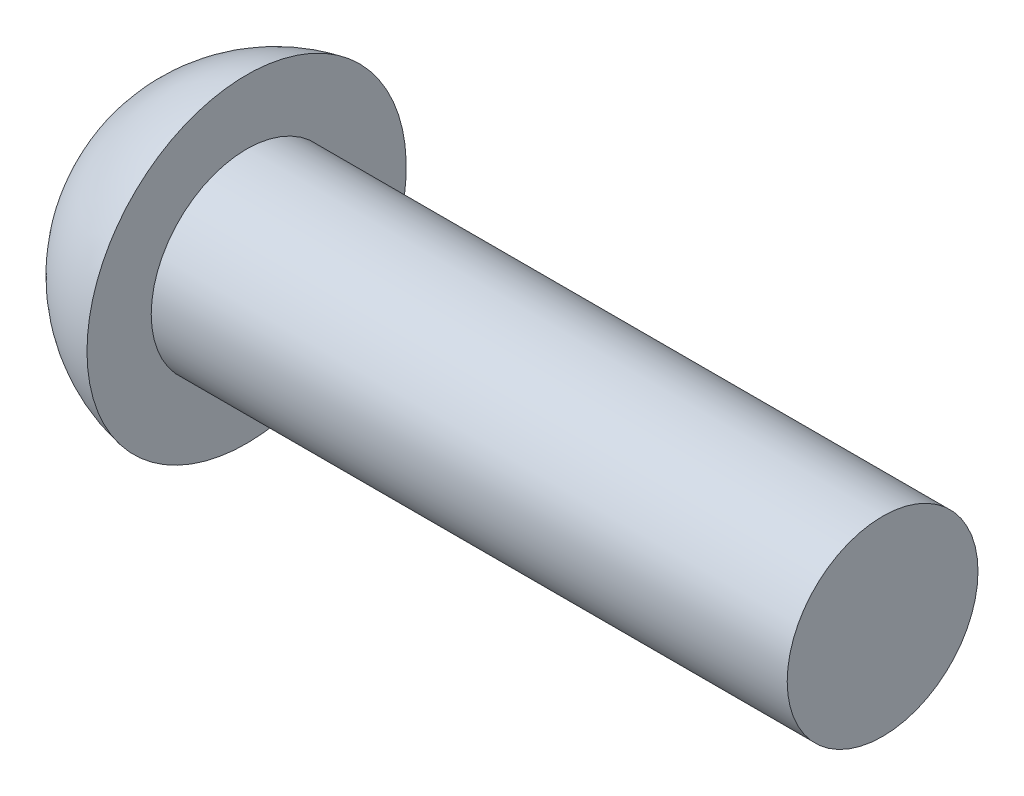
ISO-10303-21;
HEADER;
FILE_DESCRIPTION(('STEP AP214'),'2;1');
FILE_NAME('part.step','',(''),(''),'','','');
FILE_SCHEMA(('AUTOMOTIVE_DESIGN { 1 0 10303 214 1 1 1 1 }'));
ENDSEC;
DATA;
#1=APPLICATION_CONTEXT('core data for automotive mechanical design processes');
#2=APPLICATION_PROTOCOL_DEFINITION('international standard','automotive_design',2000,#1);
#3=PRODUCT_CONTEXT('',#1,'mechanical');
#4=PRODUCT('Part','Part','',(#3));
#5=PRODUCT_RELATED_PRODUCT_CATEGORY('part','',(#4));
#6=PRODUCT_DEFINITION_FORMATION('','',#4);
#7=PRODUCT_DEFINITION_CONTEXT('part definition',#1,'design');
#8=PRODUCT_DEFINITION('design','',#6,#7);
#9=PRODUCT_DEFINITION_SHAPE('','',#8);
#10=(LENGTH_UNIT() NAMED_UNIT(*) SI_UNIT(.MILLI.,.METRE.));
#11=(NAMED_UNIT(*) PLANE_ANGLE_UNIT() SI_UNIT($,.RADIAN.));
#12=(NAMED_UNIT(*) SI_UNIT($,.STERADIAN.) SOLID_ANGLE_UNIT());
#13=UNCERTAINTY_MEASURE_WITH_UNIT(LENGTH_MEASURE(1.E-05),#10,'distance_accuracy_value','');
#14=(GEOMETRIC_REPRESENTATION_CONTEXT(3) GLOBAL_UNCERTAINTY_ASSIGNED_CONTEXT((#13)) GLOBAL_UNIT_ASSIGNED_CONTEXT((#10,
#11,#12)) REPRESENTATION_CONTEXT('',''));
#15=CARTESIAN_POINT('',(0.,0.,0.));
#16=DIRECTION('',(0.,0.,1.));
#17=DIRECTION('',(1.,0.,0.));
#18=AXIS2_PLACEMENT_3D('',#15,#16,#17);
#19=CARTESIAN_POINT('',(5.1,0.,0.));
#20=DIRECTION('',(-1.,0.,0.));
#21=DIRECTION('',(0.,1.,0.));
#22=AXIS2_PLACEMENT_3D('',#19,#20,#21);
#23=SPHERICAL_SURFACE('',#22,5.1);
#24=CARTESIAN_POINT('',(4.2,0.,0.));
#25=DIRECTION('',(-1.,0.,0.));
#26=DIRECTION('',(0.,0.,1.));
#27=AXIS2_PLACEMENT_3D('',#24,#25,#26);
#28=CIRCLE('',#27,5.01996015920445);
#29=CARTESIAN_POINT('',(4.2,0.,5.01996015920445));
#30=VERTEX_POINT('',#29);
#31=EDGE_CURVE('E195',#30,#30,#28,.T.);
#32=ORIENTED_EDGE('',*,*,#31,.T.);
#33=EDGE_LOOP('',(#32));
#34=FACE_BOUND('',#33,.T.);
#35=CARTESIAN_POINT('',(0.222124133816635,0.,0.));
#36=DIRECTION('',(1.,0.,0.));
#37=DIRECTION('',(0.,0.,-1.));
#38=AXIS2_PLACEMENT_3D('',#35,#36,#37);
#39=CIRCLE('',#38,1.4887333656857);
#40=CARTESIAN_POINT('',(0.222124133816634,-0.409999999999995,-1.43116282585382));
#41=VERTEX_POINT('',#40);
#42=CARTESIAN_POINT('',(0.222124133816635,-1.43116282585382,-0.41));
#43=VERTEX_POINT('',#42);
#44=EDGE_CURVE('E317',#41,#43,#39,.F.);
#45=ORIENTED_EDGE('',*,*,#44,.F.);
#46=CARTESIAN_POINT('',(5.1,-0.41,0.));
#47=DIRECTION('',(0.,1.,0.));
#48=DIRECTION('',(0.,0.,1.));
#49=AXIS2_PLACEMENT_3D('',#46,#47,#48);
#50=CIRCLE('',#49,5.08349289367065);
#51=CARTESIAN_POINT('',(0.997910990339142,-0.409999999999989,-3.00245995091019));
#52=VERTEX_POINT('',#51);
#53=EDGE_CURVE('E244',#52,#41,#50,.T.);
#54=ORIENTED_EDGE('',*,*,#53,.F.);
#55=CARTESIAN_POINT('',(5.4822404787185,0.,-0.766655820699222));
#56=DIRECTION('',(0.446197800778958,0.,-0.89493436774996));
#57=DIRECTION('',(-0.89493436774996,0.,-0.446197800778958));
#58=AXIS2_PLACEMENT_3D('',#55,#56,#57);
#59=CIRCLE('',#58,5.02753727674068);
#60=CARTESIAN_POINT('',(0.997910990339142,0.41000000000001,-3.00245995091018));
#61=VERTEX_POINT('',#60);
#62=EDGE_CURVE('E218',#52,#61,#59,.T.);
#63=ORIENTED_EDGE('',*,*,#62,.T.);
#64=CARTESIAN_POINT('',(5.1,0.41,0.));
#65=DIRECTION('',(0.,-1.,0.));
#66=DIRECTION('',(0.,0.,-1.));
#67=AXIS2_PLACEMENT_3D('',#64,#65,#66);
#68=CIRCLE('',#67,5.08349289367065);
#69=CARTESIAN_POINT('',(0.222124133816635,0.410000000000005,-1.43116282585381));
#70=VERTEX_POINT('',#69);
#71=EDGE_CURVE('E273',#70,#61,#68,.T.);
#72=ORIENTED_EDGE('',*,*,#71,.F.);
#73=CARTESIAN_POINT('',(0.222124133816635,1.43116282585382,-0.41));
#74=VERTEX_POINT('',#73);
#75=EDGE_CURVE('E333',#74,#70,#39,.F.);
#76=ORIENTED_EDGE('',*,*,#75,.F.);
#77=CARTESIAN_POINT('',(5.1,0.,-0.41));
#78=DIRECTION('',(0.,0.,1.));
#79=DIRECTION('',(1.,0.,0.));
#80=AXIS2_PLACEMENT_3D('',#77,#78,#79);
#81=CIRCLE('',#80,5.08349289367065);
#82=CARTESIAN_POINT('',(0.997910990339142,3.00245995091019,-0.41));
#83=VERTEX_POINT('',#82);
#84=EDGE_CURVE('E212',#83,#74,#81,.T.);
#85=ORIENTED_EDGE('',*,*,#84,.F.);
#86=CARTESIAN_POINT('',(5.4822404787185,0.766655820699222,0.));
#87=DIRECTION('',(0.446197800778958,0.89493436774996,0.));
#88=DIRECTION('',(-0.89493436774996,0.446197800778958,0.));
#89=AXIS2_PLACEMENT_3D('',#86,#87,#88);
#90=CIRCLE('',#89,5.02753727674068);
#91=CARTESIAN_POINT('',(0.997910990339142,3.00245995091019,0.41));
#92=VERTEX_POINT('',#91);
#93=EDGE_CURVE('E215',#83,#92,#90,.T.);
#94=ORIENTED_EDGE('',*,*,#93,.T.);
#95=CARTESIAN_POINT('',(5.1,0.,0.41));
#96=DIRECTION('',(0.,0.,-1.));
#97=DIRECTION('',(0.,1.,0.));
#98=AXIS2_PLACEMENT_3D('',#95,#96,#97);
#99=CIRCLE('',#98,5.08349289367065);
#100=CARTESIAN_POINT('',(0.222124133816635,1.43116282585381,0.41));
#101=VERTEX_POINT('',#100);
#102=EDGE_CURVE('E203',#101,#92,#99,.T.);
#103=ORIENTED_EDGE('',*,*,#102,.F.);
#104=CARTESIAN_POINT('',(0.222124133816634,0.409999999999995,1.43116282585382));
#105=VERTEX_POINT('',#104);
#106=EDGE_CURVE('E332',#105,#101,#39,.F.);
#107=ORIENTED_EDGE('',*,*,#106,.F.);
#108=CARTESIAN_POINT('',(0.997910990339142,0.409999999999989,3.00245995091019));
#109=VERTEX_POINT('',#108);
#110=EDGE_CURVE('E228',#109,#105,#68,.T.);
#111=ORIENTED_EDGE('',*,*,#110,.F.);
#112=CARTESIAN_POINT('',(5.4822404787185,0.,0.766655820699223));
#113=DIRECTION('',(0.446197800778958,0.,0.89493436774996));
#114=DIRECTION('',(0.89493436774996,0.,-0.446197800778958));
#115=AXIS2_PLACEMENT_3D('',#112,#113,#114);
#116=CIRCLE('',#115,5.02753727674068);
#117=CARTESIAN_POINT('',(0.997910990339142,-0.41000000000001,3.00245995091018));
#118=VERTEX_POINT('',#117);
#119=EDGE_CURVE('E47',#109,#118,#116,.T.);
#120=ORIENTED_EDGE('',*,*,#119,.T.);
#121=CARTESIAN_POINT('',(0.222124133816635,-0.410000000000005,1.43116282585381));
#122=VERTEX_POINT('',#121);
#123=EDGE_CURVE('E225',#122,#118,#50,.T.);
#124=ORIENTED_EDGE('',*,*,#123,.F.);
#125=CARTESIAN_POINT('',(0.222124133816635,-1.43116282585382,0.409999999999999));
#126=VERTEX_POINT('',#125);
#127=EDGE_CURVE('E363',#126,#122,#39,.F.);
#128=ORIENTED_EDGE('',*,*,#127,.F.);
#129=CARTESIAN_POINT('',(0.997910990339142,-3.00245995091019,0.409999999999999));
#130=VERTEX_POINT('',#129);
#131=EDGE_CURVE('E209',#130,#126,#99,.T.);
#132=ORIENTED_EDGE('',*,*,#131,.F.);
#133=CARTESIAN_POINT('',(5.4822404787185,-0.766655820699223,0.));
#134=DIRECTION('',(0.446197800778958,-0.89493436774996,0.));
#135=DIRECTION('',(0.89493436774996,0.446197800778958,0.));
#136=AXIS2_PLACEMENT_3D('',#133,#134,#135);
#137=CIRCLE('',#136,5.02753727674068);
#138=CARTESIAN_POINT('',(0.997910990339142,-3.00245995091019,-0.41));
#139=VERTEX_POINT('',#138);
#140=EDGE_CURVE('E200',#130,#139,#137,.T.);
#141=ORIENTED_EDGE('',*,*,#140,.T.);
#142=EDGE_CURVE('E62',#43,#139,#81,.T.);
#143=ORIENTED_EDGE('',*,*,#142,.F.);
#144=EDGE_LOOP('',(#45,#54,#63,#72,#76,#85,#94,#103,#107,#111,#120,#124,#128,#132,#141,#143));
#145=FACE_BOUND('',#144,.T.);
#146=ADVANCED_FACE('F34',(#34,#145),#23,.T.);
#147=CARTESIAN_POINT('',(3.2,1.90453890928056,-0.41));
#148=DIRECTION('',(0.,0.,1.));
#149=DIRECTION('',(1.,0.,0.));
#150=AXIS2_PLACEMENT_3D('',#147,#148,#149);
#151=PLANE('',#150);
#152=ORIENTED_EDGE('',*,*,#84,.T.);
#153=CARTESIAN_POINT('',(-2.28100022721396,1.61245987855127,-0.41));
#154=CARTESIAN_POINT('',(-1.82356462638218,1.57945364557636,-0.41));
#155=CARTESIAN_POINT('',(-1.36613324244612,1.5463888289135,-0.41));
#156=CARTESIAN_POINT('',(-0.451281022579982,1.4801104064138,-0.41));
#157=CARTESIAN_POINT('',(0.00613981334463958,1.44689680050155,-0.41));
#158=CARTESIAN_POINT('',(0.920968357081412,1.38028921125837,-0.41));
#159=CARTESIAN_POINT('',(1.37837606489363,1.34689522792831,-0.41));
#160=CARTESIAN_POINT('',(2.29317480319328,1.27988185298036,-0.41));
#161=CARTESIAN_POINT('',(2.7505658336868,1.2462624614456,-0.41));
#162=CARTESIAN_POINT('',(3.75464222224439,1.17214568320231,-0.41));
#163=CARTESIAN_POINT('',(4.30132307548286,1.13158718653521,-0.41));
#164=CARTESIAN_POINT('',(5.39464289033181,1.04991236378925,-0.41));
#165=CARTESIAN_POINT('',(5.941281851962,1.00879603797421,-0.41));
#166=CARTESIAN_POINT('',(7.03450145379373,0.925769138257099,-0.41));
#167=CARTESIAN_POINT('',(7.58108209380094,0.88385856178672,-0.41));
#168=CARTESIAN_POINT('',(8.40088322661265,0.820087233843588,-0.41));
#169=CARTESIAN_POINT('',(8.67413889343034,0.798679193153557,-0.41));
#170=CARTESIAN_POINT('',(9.22061934404074,0.755470306470554,-0.41));
#171=CARTESIAN_POINT('',(9.49384412781117,0.733669460196031,-0.41));
#172=CARTESIAN_POINT('',(9.76704955739896,0.711626728086535,-0.41));
#173=B_SPLINE_CURVE_WITH_KNOTS('',3,(#153,#154,#155,#156,#157,#158,#159,#160,#161,#162,#163,
#164,#165,#166,#167,#168,#169,#170,#171,#172),.UNSPECIFIED.,.F.,.F.,(4,2,2,2,2,2,2,2,2,4),(0.,
1.37587451964125,2.75174973665231,4.12762494710747,5.50349965023208,7.14804937834856,
8.79259832870417,10.4371525978129,11.2594312998381,12.0817105912707),.UNSPECIFIED.);
#174=CARTESIAN_POINT('',(3.2,1.21308707436853,-0.41));
#175=VERTEX_POINT('',#174);
#176=EDGE_CURVE('E352',#74,#175,#173,.T.);
#177=ORIENTED_EDGE('',*,*,#176,.T.);
#178=DIRECTION('',(0.,1.,0.));
#179=VECTOR('',#178,1.);
#180=CARTESIAN_POINT('',(3.2,-1.90453890928056,-0.41));
#181=LINE('',#180,#179);
#182=CARTESIAN_POINT('',(3.2,1.90453890928056,-0.41));
#183=VERTEX_POINT('',#182);
#184=EDGE_CURVE('E296',#175,#183,#181,.T.);
#185=ORIENTED_EDGE('',*,*,#184,.T.);
#186=DIRECTION('',(0.89493436774996,-0.446197800778958,0.));
#187=VECTOR('',#186,1.);
#188=CARTESIAN_POINT('',(0.,3.5,-0.41));
#189=LINE('',#188,#187);
#190=EDGE_CURVE('E274',#83,#183,#189,.T.);
#191=ORIENTED_EDGE('',*,*,#190,.F.);
#192=EDGE_LOOP('',(#152,#177,#185,#191));
#193=FACE_BOUND('',#192,.T.);
#194=ADVANCED_FACE('F168',(#193),#151,.T.);
#195=CARTESIAN_POINT('',(3.2,-1.90453890928056,-0.41));
#196=VERTEX_POINT('',#195);
#197=CARTESIAN_POINT('',(3.2,-1.21308707436853,-0.41));
#198=VERTEX_POINT('',#197);
#199=EDGE_CURVE('E294',#196,#198,#181,.T.);
#200=ORIENTED_EDGE('',*,*,#199,.T.);
#201=CARTESIAN_POINT('',(-2.28100022721396,-1.61245987855127,-0.41));
#202=CARTESIAN_POINT('',(-1.82356462638219,-1.57945364557636,-0.41));
#203=CARTESIAN_POINT('',(-1.36613324244613,-1.5463888289135,-0.41));
#204=CARTESIAN_POINT('',(-0.451281022579983,-1.4801104064138,-0.41));
#205=CARTESIAN_POINT('',(0.00613981334463844,-1.44689680050155,-0.41));
#206=CARTESIAN_POINT('',(0.920968357081412,-1.38028921125837,-0.41));
#207=CARTESIAN_POINT('',(1.37837606489363,-1.34689522792831,-0.41));
#208=CARTESIAN_POINT('',(2.29317480319328,-1.27988185298036,-0.41));
#209=CARTESIAN_POINT('',(2.7505658336868,-1.2462624614456,-0.41));
#210=CARTESIAN_POINT('',(3.75464222224439,-1.17214568320231,-0.41));
#211=CARTESIAN_POINT('',(4.30132307548286,-1.13158718653521,-0.41));
#212=CARTESIAN_POINT('',(5.39464289033181,-1.04991236378925,-0.41));
#213=CARTESIAN_POINT('',(5.941281851962,-1.00879603797421,-0.41));
#214=CARTESIAN_POINT('',(7.03450145379373,-0.925769138257099,-0.41));
#215=CARTESIAN_POINT('',(7.58108209380094,-0.88385856178672,-0.41));
#216=CARTESIAN_POINT('',(8.40088322661264,-0.820087233843588,-0.41));
#217=CARTESIAN_POINT('',(8.67413889343034,-0.798679193153557,-0.41));
#218=CARTESIAN_POINT('',(9.22061934404074,-0.755470306470554,-0.41));
#219=CARTESIAN_POINT('',(9.49384412781117,-0.733669460196031,-0.41));
#220=CARTESIAN_POINT('',(9.76704955739897,-0.711626728086535,-0.41));
#221=B_SPLINE_CURVE_WITH_KNOTS('',3,(#201,#202,#203,#204,#205,#206,#207,#208,#209,#210,#211,
#212,#213,#214,#215,#216,#217,#218,#219,#220),.UNSPECIFIED.,.F.,.F.,(4,2,2,2,2,2,2,2,2,4),(0.,
1.37587451964125,2.75174973665231,4.12762494710747,5.50349965023208,7.14804937834857,
8.79259832870417,10.4371525978129,11.2594312998381,12.0817105912707),.UNSPECIFIED.);
#222=EDGE_CURVE('E331',#198,#43,#221,.F.);
#223=ORIENTED_EDGE('',*,*,#222,.T.);
#224=ORIENTED_EDGE('',*,*,#142,.T.);
#225=DIRECTION('',(0.89493436774996,0.446197800778958,0.));
#226=VECTOR('',#225,1.);
#227=CARTESIAN_POINT('',(0.,-3.5,-0.41));
#228=LINE('',#227,#226);
#229=EDGE_CURVE('E279',#139,#196,#228,.T.);
#230=ORIENTED_EDGE('',*,*,#229,.T.);
#231=EDGE_LOOP('',(#200,#223,#224,#230));
#232=FACE_BOUND('',#231,.T.);
#233=ADVANCED_FACE('F174',(#232),#151,.T.);
#234=CARTESIAN_POINT('',(3.2,-1.90453890928056,0.41));
#235=DIRECTION('',(0.,0.,-1.));
#236=DIRECTION('',(0.,1.,0.));
#237=AXIS2_PLACEMENT_3D('',#234,#235,#236);
#238=PLANE('',#237);
#239=DIRECTION('',(0.,-1.,0.));
#240=VECTOR('',#239,1.);
#241=CARTESIAN_POINT('',(3.2,1.90453890928056,0.41));
#242=LINE('',#241,#240);
#243=CARTESIAN_POINT('',(3.2,1.90453890928056,0.41));
#244=VERTEX_POINT('',#243);
#245=CARTESIAN_POINT('',(3.2,1.21308707436853,0.41));
#246=VERTEX_POINT('',#245);
#247=EDGE_CURVE('E287',#244,#246,#242,.T.);
#248=ORIENTED_EDGE('',*,*,#247,.T.);
#249=CARTESIAN_POINT('',(-2.28100022722107,1.61245987855178,0.41));
#250=CARTESIAN_POINT('',(-1.8235646263882,1.5794536455768,0.41));
#251=CARTESIAN_POINT('',(-1.36613324245104,1.54638882891386,0.41));
#252=CARTESIAN_POINT('',(-0.451281022582683,1.480110406414,0.41));
#253=CARTESIAN_POINT('',(0.0061398133430432,1.44689680050166,0.41));
#254=CARTESIAN_POINT('',(0.920968357082193,1.38028921125832,0.41));
#255=CARTESIAN_POINT('',(1.37837606489568,1.34689522792816,0.41));
#256=CARTESIAN_POINT('',(2.29317480319787,1.27988185298003,0.41));
#257=CARTESIAN_POINT('',(2.75056583369267,1.24626246144517,0.41));
#258=CARTESIAN_POINT('',(3.75464222225153,1.17214568320178,0.41));
#259=CARTESIAN_POINT('',(4.30132307548999,1.13158718653468,0.41));
#260=CARTESIAN_POINT('',(5.39464289033895,1.04991236378871,0.41));
#261=CARTESIAN_POINT('',(5.94128185196913,1.00879603797367,0.41));
#262=CARTESIAN_POINT('',(7.03450145380087,0.925769138256553,0.41));
#263=CARTESIAN_POINT('',(7.58108209380807,0.88385856178617,0.41));
#264=CARTESIAN_POINT('',(8.40088322661978,0.82008723384303,0.41));
#265=CARTESIAN_POINT('',(8.67413889343747,0.798679193152997,0.41));
#266=CARTESIAN_POINT('',(9.22061934404787,0.755470306469987,0.41));
#267=CARTESIAN_POINT('',(9.49384412781831,0.733669460195459,0.41));
#268=CARTESIAN_POINT('',(9.7670495574061,0.711626728085959,0.41));
#269=B_SPLINE_CURVE_WITH_KNOTS('',3,(#249,#250,#251,#252,#253,#254,#255,#256,#257,#258,#259,
#260,#261,#262,#263,#264,#265,#266,#267,#268),.UNSPECIFIED.,.F.,.F.,(4,2,2,2,2,2,2,2,2,4),(0.,
1.37587451964457,2.75174973665895,4.12762494711794,5.50349965024638,7.14804937836286,
8.79259832871846,10.4371525978272,11.2594312998524,12.081710591285),.UNSPECIFIED.);
#270=EDGE_CURVE('E249',#246,#101,#269,.F.);
#271=ORIENTED_EDGE('',*,*,#270,.T.);
#272=ORIENTED_EDGE('',*,*,#102,.T.);
#273=DIRECTION('',(0.89493436774996,-0.446197800778958,0.));
#274=VECTOR('',#273,1.);
#275=CARTESIAN_POINT('',(0.,3.5,0.41));
#276=LINE('',#275,#274);
#277=EDGE_CURVE('E277',#92,#244,#276,.T.);
#278=ORIENTED_EDGE('',*,*,#277,.T.);
#279=EDGE_LOOP('',(#248,#271,#272,#278));
#280=FACE_BOUND('',#279,.T.);
#281=ADVANCED_FACE('F348',(#280),#238,.T.);
#282=ORIENTED_EDGE('',*,*,#131,.T.);
#283=CARTESIAN_POINT('',(-2.28100022721396,-1.61245987855127,0.409999999999999));
#284=CARTESIAN_POINT('',(-1.82356462638219,-1.57945364557636,0.409999999999999));
#285=CARTESIAN_POINT('',(-1.36613324244613,-1.5463888289135,0.409999999999999));
#286=CARTESIAN_POINT('',(-0.451281022579983,-1.4801104064138,0.409999999999999));
#287=CARTESIAN_POINT('',(0.00613981334463828,-1.44689680050155,0.41));
#288=CARTESIAN_POINT('',(0.920968357081412,-1.38028921125837,0.41));
#289=CARTESIAN_POINT('',(1.37837606489363,-1.34689522792831,0.41));
#290=CARTESIAN_POINT('',(2.29317480319328,-1.27988185298036,0.41));
#291=CARTESIAN_POINT('',(2.7505658336868,-1.2462624614456,0.41));
#292=CARTESIAN_POINT('',(3.75464222224439,-1.17214568320231,0.41));
#293=CARTESIAN_POINT('',(4.30132307548285,-1.13158718653521,0.41));
#294=CARTESIAN_POINT('',(5.39464289033181,-1.04991236378925,0.41));
#295=CARTESIAN_POINT('',(5.94128185196199,-1.00879603797421,0.41));
#296=CARTESIAN_POINT('',(7.03450145379372,-0.925769138257099,0.41));
#297=CARTESIAN_POINT('',(7.58108209380093,-0.88385856178672,0.41));
#298=CARTESIAN_POINT('',(8.40088322661264,-0.820087233843588,0.41));
#299=CARTESIAN_POINT('',(8.67413889343034,-0.798679193153557,0.41));
#300=CARTESIAN_POINT('',(9.22061934404074,-0.755470306470554,0.41));
#301=CARTESIAN_POINT('',(9.49384412781117,-0.733669460196031,0.41));
#302=CARTESIAN_POINT('',(9.76704955739896,-0.711626728086535,0.41));
#303=B_SPLINE_CURVE_WITH_KNOTS('',3,(#283,#284,#285,#286,#287,#288,#289,#290,#291,#292,#293,
#294,#295,#296,#297,#298,#299,#300,#301,#302),.UNSPECIFIED.,.F.,.F.,(4,2,2,2,2,2,2,2,2,4),(0.,
1.37587451964125,2.75174973665231,4.12762494710747,5.50349965023208,7.14804937834856,
8.79259832870416,10.4371525978129,11.2594312998381,12.0817105912707),.UNSPECIFIED.);
#304=CARTESIAN_POINT('',(3.2,-1.21308707436853,0.41));
#305=VERTEX_POINT('',#304);
#306=EDGE_CURVE('E364',#126,#305,#303,.T.);
#307=ORIENTED_EDGE('',*,*,#306,.T.);
#308=CARTESIAN_POINT('',(3.2,-1.90453890928056,0.41));
#309=VERTEX_POINT('',#308);
#310=EDGE_CURVE('E290',#305,#309,#242,.T.);
#311=ORIENTED_EDGE('',*,*,#310,.T.);
#312=DIRECTION('',(0.89493436774996,0.446197800778958,0.));
#313=VECTOR('',#312,1.);
#314=CARTESIAN_POINT('',(0.,-3.5,0.409999999999999));
#315=LINE('',#314,#313);
#316=EDGE_CURVE('E281',#130,#309,#315,.T.);
#317=ORIENTED_EDGE('',*,*,#316,.F.);
#318=EDGE_LOOP('',(#282,#307,#311,#317));
#319=FACE_BOUND('',#318,.T.);
#320=ADVANCED_FACE('F392',(#319),#238,.T.);
#321=CARTESIAN_POINT('',(3.2,1.90453890928056,-0.41));
#322=DIRECTION('',(-1.,0.,0.));
#323=DIRECTION('',(0.,0.,1.));
#324=AXIS2_PLACEMENT_3D('',#321,#322,#323);
#325=PLANE('',#324);
#326=ORIENTED_EDGE('',*,*,#310,.F.);
#327=CARTESIAN_POINT('',(3.2,0.,0.));
#328=DIRECTION('',(-1.,0.,0.));
#329=DIRECTION('',(0.,0.,1.));
#330=AXIS2_PLACEMENT_3D('',#327,#328,#329);
#331=CIRCLE('',#330,1.2805);
#332=EDGE_CURVE('E326',#198,#305,#331,.T.);
#333=ORIENTED_EDGE('',*,*,#332,.F.);
#334=ORIENTED_EDGE('',*,*,#199,.F.);
#335=DIRECTION('',(0.,0.,1.));
#336=VECTOR('',#335,1.);
#337=CARTESIAN_POINT('',(3.2,-1.90453890928056,-0.41));
#338=LINE('',#337,#336);
#339=EDGE_CURVE('E284',#196,#309,#338,.T.);
#340=ORIENTED_EDGE('',*,*,#339,.T.);
#341=EDGE_LOOP('',(#326,#333,#334,#340));
#342=FACE_BOUND('',#341,.T.);
#343=ADVANCED_FACE('F390',(#342),#325,.T.);
#344=DIRECTION('',(0.,0.,-1.));
#345=VECTOR('',#344,1.);
#346=CARTESIAN_POINT('',(3.2,-0.410000000000007,1.90453890928056));
#347=LINE('',#346,#345);
#348=CARTESIAN_POINT('',(3.2,-0.409999999999995,-1.21308707436853));
#349=VERTEX_POINT('',#348);
#350=CARTESIAN_POINT('',(3.2,-0.409999999999993,-1.90453890928056));
#351=VERTEX_POINT('',#350);
#352=EDGE_CURVE('E266',#349,#351,#347,.T.);
#353=ORIENTED_EDGE('',*,*,#352,.F.);
#354=CARTESIAN_POINT('',(3.2,0.410000000000004,-1.21308707436853));
#355=VERTEX_POINT('',#354);
#356=EDGE_CURVE('E54',#355,#349,#331,.T.);
#357=ORIENTED_EDGE('',*,*,#356,.F.);
#358=DIRECTION('',(0.,0.,1.));
#359=VECTOR('',#358,1.);
#360=CARTESIAN_POINT('',(3.2,0.410000000000007,-1.90453890928056));
#361=LINE('',#360,#359);
#362=CARTESIAN_POINT('',(3.2,0.410000000000007,-1.90453890928056));
#363=VERTEX_POINT('',#362);
#364=EDGE_CURVE('E269',#363,#355,#361,.T.);
#365=ORIENTED_EDGE('',*,*,#364,.F.);
#366=DIRECTION('',(0.,-1.,0.));
#367=VECTOR('',#366,1.);
#368=CARTESIAN_POINT('',(3.2,0.410000000000007,-1.90453890928056));
#369=LINE('',#368,#367);
#370=EDGE_CURVE('E260',#363,#351,#369,.T.);
#371=ORIENTED_EDGE('',*,*,#370,.T.);
#372=EDGE_LOOP('',(#353,#357,#365,#371));
#373=FACE_BOUND('',#372,.T.);
#374=ADVANCED_FACE('F321',(#373),#325,.T.);
#375=ORIENTED_EDGE('',*,*,#184,.F.);
#376=EDGE_CURVE('E325',#246,#175,#331,.T.);
#377=ORIENTED_EDGE('',*,*,#376,.F.);
#378=ORIENTED_EDGE('',*,*,#247,.F.);
#379=DIRECTION('',(0.,0.,-1.));
#380=VECTOR('',#379,1.);
#381=CARTESIAN_POINT('',(3.2,1.90453890928056,0.41));
#382=LINE('',#381,#380);
#383=EDGE_CURVE('E291',#244,#183,#382,.T.);
#384=ORIENTED_EDGE('',*,*,#383,.T.);
#385=EDGE_LOOP('',(#375,#377,#378,#384));
#386=FACE_BOUND('',#385,.T.);
#387=ADVANCED_FACE('F399',(#386),#325,.T.);
#388=CARTESIAN_POINT('',(3.2,0.409999999999996,1.21308707436853));
#389=VERTEX_POINT('',#388);
#390=CARTESIAN_POINT('',(3.2,0.409999999999993,1.90453890928056));
#391=VERTEX_POINT('',#390);
#392=EDGE_CURVE('E242',#389,#391,#361,.T.);
#393=ORIENTED_EDGE('',*,*,#392,.F.);
#394=CARTESIAN_POINT('',(3.2,-0.410000000000004,1.21308707436853));
#395=VERTEX_POINT('',#394);
#396=EDGE_CURVE('E329',#395,#389,#331,.T.);
#397=ORIENTED_EDGE('',*,*,#396,.F.);
#398=CARTESIAN_POINT('',(3.2,-0.410000000000007,1.90453890928056));
#399=VERTEX_POINT('',#398);
#400=EDGE_CURVE('E263',#399,#395,#347,.T.);
#401=ORIENTED_EDGE('',*,*,#400,.F.);
#402=DIRECTION('',(0.,1.,0.));
#403=VECTOR('',#402,1.);
#404=CARTESIAN_POINT('',(3.2,-0.410000000000007,1.90453890928056));
#405=LINE('',#404,#403);
#406=EDGE_CURVE('E267',#399,#391,#405,.T.);
#407=ORIENTED_EDGE('',*,*,#406,.T.);
#408=EDGE_LOOP('',(#393,#397,#401,#407));
#409=FACE_BOUND('',#408,.T.);
#410=ADVANCED_FACE('F394',(#409),#325,.T.);
#411=CARTESIAN_POINT('',(3.2,0.409999999999993,1.90453890928056));
#412=DIRECTION('',(0.,-1.,0.));
#413=DIRECTION('',(1.,0.,0.));
#414=AXIS2_PLACEMENT_3D('',#411,#412,#413);
#415=PLANE('',#414);
#416=ORIENTED_EDGE('',*,*,#110,.T.);
#417=CARTESIAN_POINT('',(-2.28100022722107,0.409999999999994,1.61245987855178));
#418=CARTESIAN_POINT('',(-1.8235646263882,0.409999999999994,1.5794536455768));
#419=CARTESIAN_POINT('',(-1.36613324245104,0.409999999999995,1.54638882891386));
#420=CARTESIAN_POINT('',(-0.451281022582683,0.409999999999995,1.480110406414));
#421=CARTESIAN_POINT('',(0.00613981334304315,0.409999999999995,1.44689680050167));
#422=CARTESIAN_POINT('',(0.920968357082193,0.409999999999995,1.38028921125832));
#423=CARTESIAN_POINT('',(1.37837606489568,0.409999999999995,1.34689522792816));
#424=CARTESIAN_POINT('',(2.29317480319787,0.409999999999995,1.27988185298003));
#425=CARTESIAN_POINT('',(2.75056583369267,0.409999999999996,1.24626246144517));
#426=CARTESIAN_POINT('',(3.75464222225153,0.409999999999996,1.17214568320178));
#427=CARTESIAN_POINT('',(4.30132307548999,0.409999999999996,1.13158718653468));
#428=CARTESIAN_POINT('',(5.39464289033895,0.409999999999996,1.04991236378871));
#429=CARTESIAN_POINT('',(5.94128185196913,0.409999999999996,1.00879603797367));
#430=CARTESIAN_POINT('',(7.03450145380086,0.409999999999997,0.925769138256554));
#431=CARTESIAN_POINT('',(7.58108209380807,0.409999999999997,0.883858561786172));
#432=CARTESIAN_POINT('',(8.40088322661978,0.409999999999997,0.820087233843032));
#433=CARTESIAN_POINT('',(8.67413889343747,0.409999999999997,0.798679193152998));
#434=CARTESIAN_POINT('',(9.22061934404787,0.409999999999997,0.755470306469988));
#435=CARTESIAN_POINT('',(9.4938441278183,0.409999999999997,0.733669460195461));
#436=CARTESIAN_POINT('',(9.7670495574061,0.409999999999997,0.711626728085961));
#437=B_SPLINE_CURVE_WITH_KNOTS('',3,(#417,#418,#419,#420,#421,#422,#423,#424,#425,#426,#427,
#428,#429,#430,#431,#432,#433,#434,#435,#436),.UNSPECIFIED.,.F.,.F.,(4,2,2,2,2,2,2,2,2,4),(0.,
1.37587451964457,2.75174973665895,4.12762494711794,5.50349965024638,7.14804937836286,
8.79259832871846,10.4371525978272,11.2594312998524,12.081710591285),.UNSPECIFIED.);
#438=EDGE_CURVE('E414',#105,#389,#437,.T.);
#439=ORIENTED_EDGE('',*,*,#438,.T.);
#440=ORIENTED_EDGE('',*,*,#392,.T.);
#441=DIRECTION('',(0.89493436774996,0.,-0.446197800778958));
#442=VECTOR('',#441,1.);
#443=CARTESIAN_POINT('',(0.,0.409999999999988,3.5));
#444=LINE('',#443,#442);
#445=EDGE_CURVE('E235',#109,#391,#444,.T.);
#446=ORIENTED_EDGE('',*,*,#445,.F.);
#447=EDGE_LOOP('',(#416,#439,#440,#446));
#448=FACE_BOUND('',#447,.T.);
#449=ADVANCED_FACE('F239',(#448),#415,.T.);
#450=CARTESIAN_POINT('',(3.2,-0.409999999999993,-1.90453890928056));
#451=DIRECTION('',(0.,1.,0.));
#452=DIRECTION('',(0.,0.,1.));
#453=AXIS2_PLACEMENT_3D('',#450,#451,#452);
#454=PLANE('',#453);
#455=ORIENTED_EDGE('',*,*,#400,.T.);
#456=CARTESIAN_POINT('',(-2.28100022722107,-0.410000000000005,1.61245987855178));
#457=CARTESIAN_POINT('',(-1.8235646263882,-0.410000000000005,1.57945364557679));
#458=CARTESIAN_POINT('',(-1.36613324245104,-0.410000000000005,1.54638882891386));
#459=CARTESIAN_POINT('',(-0.451281022582683,-0.410000000000005,1.48011040641399));
#460=CARTESIAN_POINT('',(0.00613981334304298,-0.410000000000005,1.44689680050166));
#461=CARTESIAN_POINT('',(0.920968357082193,-0.410000000000005,1.38028921125832));
#462=CARTESIAN_POINT('',(1.37837606489568,-0.410000000000005,1.34689522792816));
#463=CARTESIAN_POINT('',(2.29317480319787,-0.410000000000004,1.27988185298003));
#464=CARTESIAN_POINT('',(2.75056583369267,-0.410000000000004,1.24626246144517));
#465=CARTESIAN_POINT('',(3.75464222225153,-0.410000000000004,1.17214568320177));
#466=CARTESIAN_POINT('',(4.30132307548999,-0.410000000000004,1.13158718653468));
#467=CARTESIAN_POINT('',(5.39464289033895,-0.410000000000004,1.04991236378871));
#468=CARTESIAN_POINT('',(5.94128185196913,-0.410000000000004,1.00879603797367));
#469=CARTESIAN_POINT('',(7.03450145380087,-0.410000000000003,0.925769138256552));
#470=CARTESIAN_POINT('',(7.58108209380807,-0.410000000000003,0.883858561786169));
#471=CARTESIAN_POINT('',(8.40088322661978,-0.410000000000003,0.820087233843028));
#472=CARTESIAN_POINT('',(8.67413889343747,-0.410000000000003,0.798679193152995));
#473=CARTESIAN_POINT('',(9.22061934404787,-0.410000000000003,0.755470306469985));
#474=CARTESIAN_POINT('',(9.49384412781831,-0.410000000000003,0.733669460195458));
#475=CARTESIAN_POINT('',(9.7670495574061,-0.410000000000003,0.711626728085958));
#476=B_SPLINE_CURVE_WITH_KNOTS('',3,(#456,#457,#458,#459,#460,#461,#462,#463,#464,#465,#466,
#467,#468,#469,#470,#471,#472,#473,#474,#475),.UNSPECIFIED.,.F.,.F.,(4,2,2,2,2,2,2,2,2,4),(0.,
1.37587451964457,2.75174973665895,4.12762494711794,5.50349965024638,7.14804937836286,
8.79259832871846,10.4371525978272,11.2594312998524,12.081710591285),.UNSPECIFIED.);
#477=EDGE_CURVE('E357',#395,#122,#476,.F.);
#478=ORIENTED_EDGE('',*,*,#477,.T.);
#479=ORIENTED_EDGE('',*,*,#123,.T.);
#480=DIRECTION('',(0.89493436774996,0.,-0.446197800778958));
#481=VECTOR('',#480,1.);
#482=CARTESIAN_POINT('',(0.,-0.410000000000012,3.5));
#483=LINE('',#482,#481);
#484=EDGE_CURVE('E237',#118,#399,#483,.T.);
#485=ORIENTED_EDGE('',*,*,#484,.T.);
#486=EDGE_LOOP('',(#455,#478,#479,#485));
#487=FACE_BOUND('',#486,.T.);
#488=ADVANCED_FACE('F368',(#487),#454,.T.);
#489=ORIENTED_EDGE('',*,*,#364,.T.);
#490=CARTESIAN_POINT('',(-2.28100022722107,0.410000000000006,-1.61245987855178));
#491=CARTESIAN_POINT('',(-1.8235646263882,0.410000000000005,-1.57945364557679));
#492=CARTESIAN_POINT('',(-1.36613324245104,0.410000000000005,-1.54638882891386));
#493=CARTESIAN_POINT('',(-0.451281022582683,0.410000000000005,-1.48011040641399));
#494=CARTESIAN_POINT('',(0.00613981334304336,0.410000000000005,-1.44689680050166));
#495=CARTESIAN_POINT('',(0.920968357082193,0.410000000000005,-1.38028921125832));
#496=CARTESIAN_POINT('',(1.37837606489568,0.410000000000005,-1.34689522792816));
#497=CARTESIAN_POINT('',(2.29317480319788,0.410000000000004,-1.27988185298003));
#498=CARTESIAN_POINT('',(2.75056583369267,0.410000000000004,-1.24626246144517));
#499=CARTESIAN_POINT('',(3.75464222225153,0.410000000000004,-1.17214568320177));
#500=CARTESIAN_POINT('',(4.30132307548999,0.410000000000004,-1.13158718653468));
#501=CARTESIAN_POINT('',(5.39464289033895,0.410000000000004,-1.04991236378871));
#502=CARTESIAN_POINT('',(5.94128185196913,0.410000000000004,-1.00879603797367));
#503=CARTESIAN_POINT('',(7.03450145380086,0.410000000000003,-0.925769138256552));
#504=CARTESIAN_POINT('',(7.58108209380807,0.410000000000003,-0.883858561786169));
#505=CARTESIAN_POINT('',(8.40088322661977,0.410000000000003,-0.820087233843029));
#506=CARTESIAN_POINT('',(8.67413889343747,0.410000000000003,-0.798679193152996));
#507=CARTESIAN_POINT('',(9.22061934404787,0.410000000000003,-0.755470306469985));
#508=CARTESIAN_POINT('',(9.4938441278183,0.410000000000003,-0.733669460195458));
#509=CARTESIAN_POINT('',(9.76704955740609,0.410000000000002,-0.711626728085958));
#510=B_SPLINE_CURVE_WITH_KNOTS('',3,(#490,#491,#492,#493,#494,#495,#496,#497,#498,#499,#500,
#501,#502,#503,#504,#505,#506,#507,#508,#509),.UNSPECIFIED.,.F.,.F.,(4,2,2,2,2,2,2,2,2,4),(0.,
1.37587451964457,2.75174973665895,4.12762494711794,5.50349965024638,7.14804937836286,
8.79259832871845,10.4371525978271,11.2594312998524,12.081710591285),.UNSPECIFIED.);
#511=EDGE_CURVE('E309',#355,#70,#510,.F.);
#512=ORIENTED_EDGE('',*,*,#511,.T.);
#513=ORIENTED_EDGE('',*,*,#71,.T.);
#514=DIRECTION('',(0.89493436774996,0.,0.446197800778958));
#515=VECTOR('',#514,1.);
#516=CARTESIAN_POINT('',(0.,0.410000000000012,-3.5));
#517=LINE('',#516,#515);
#518=EDGE_CURVE('E246',#61,#363,#517,.T.);
#519=ORIENTED_EDGE('',*,*,#518,.T.);
#520=EDGE_LOOP('',(#489,#512,#513,#519));
#521=FACE_BOUND('',#520,.T.);
#522=ADVANCED_FACE('F307',(#521),#415,.T.);
#523=ORIENTED_EDGE('',*,*,#53,.T.);
#524=CARTESIAN_POINT('',(-2.28100022722107,-0.409999999999994,-1.61245987855178));
#525=CARTESIAN_POINT('',(-1.8235646263882,-0.409999999999994,-1.5794536455768));
#526=CARTESIAN_POINT('',(-1.36613324245104,-0.409999999999994,-1.54638882891386));
#527=CARTESIAN_POINT('',(-0.451281022582683,-0.409999999999994,-1.480110406414));
#528=CARTESIAN_POINT('',(0.00613981334304298,-0.409999999999994,-1.44689680050167));
#529=CARTESIAN_POINT('',(0.920968357082193,-0.409999999999995,-1.38028921125832));
#530=CARTESIAN_POINT('',(1.37837606489568,-0.409999999999995,-1.34689522792816));
#531=CARTESIAN_POINT('',(2.29317480319787,-0.409999999999995,-1.27988185298003));
#532=CARTESIAN_POINT('',(2.75056583369267,-0.409999999999995,-1.24626246144517));
#533=CARTESIAN_POINT('',(3.75464222225153,-0.409999999999996,-1.17214568320178));
#534=CARTESIAN_POINT('',(4.30132307548999,-0.409999999999996,-1.13158718653468));
#535=CARTESIAN_POINT('',(5.39464289033894,-0.409999999999996,-1.04991236378871));
#536=CARTESIAN_POINT('',(5.94128185196913,-0.409999999999996,-1.00879603797367));
#537=CARTESIAN_POINT('',(7.03450145380086,-0.409999999999997,-0.925769138256555));
#538=CARTESIAN_POINT('',(7.58108209380807,-0.409999999999997,-0.883858561786172));
#539=CARTESIAN_POINT('',(8.40088322661977,-0.409999999999997,-0.820087233843032));
#540=CARTESIAN_POINT('',(8.67413889343747,-0.409999999999997,-0.798679193152998));
#541=CARTESIAN_POINT('',(9.22061934404787,-0.409999999999997,-0.755470306469988));
#542=CARTESIAN_POINT('',(9.4938441278183,-0.409999999999997,-0.733669460195461));
#543=CARTESIAN_POINT('',(9.76704955740609,-0.409999999999997,-0.711626728085961));
#544=B_SPLINE_CURVE_WITH_KNOTS('',3,(#524,#525,#526,#527,#528,#529,#530,#531,#532,#533,#534,
#535,#536,#537,#538,#539,#540,#541,#542,#543),.UNSPECIFIED.,.F.,.F.,(4,2,2,2,2,2,2,2,2,4),(0.,
1.37587451964457,2.75174973665895,4.12762494711794,5.50349965024638,7.14804937836286,
8.79259832871845,10.4371525978272,11.2594312998524,12.081710591285),.UNSPECIFIED.);
#545=EDGE_CURVE('E11',#41,#349,#544,.T.);
#546=ORIENTED_EDGE('',*,*,#545,.T.);
#547=ORIENTED_EDGE('',*,*,#352,.T.);
#548=DIRECTION('',(0.89493436774996,0.,0.446197800778958));
#549=VECTOR('',#548,1.);
#550=CARTESIAN_POINT('',(0.,-0.409999999999987,-3.5));
#551=LINE('',#550,#549);
#552=EDGE_CURVE('E257',#52,#351,#551,.T.);
#553=ORIENTED_EDGE('',*,*,#552,.F.);
#554=EDGE_LOOP('',(#523,#546,#547,#553));
#555=FACE_BOUND('',#554,.T.);
#556=ADVANCED_FACE('F191',(#555),#454,.T.);
#557=CARTESIAN_POINT('',(-25.4,0.,0.));
#558=DIRECTION('',(-1.,0.,0.));
#559=DIRECTION('',(0.,0.,1.));
#560=AXIS2_PLACEMENT_3D('',#557,#558,#559);
#561=CYLINDRICAL_SURFACE('',#560,3.);
#562=CARTESIAN_POINT('',(24.2,0.,0.));
#563=DIRECTION('',(-1.,0.,0.));
#564=DIRECTION('',(0.,0.,1.));
#565=AXIS2_PLACEMENT_3D('',#562,#563,#564);
#566=CIRCLE('',#565,3.);
#567=CARTESIAN_POINT('',(24.2,0.,3.));
#568=VERTEX_POINT('',#567);
#569=EDGE_CURVE('E205',#568,#568,#566,.T.);
#570=ORIENTED_EDGE('',*,*,#569,.T.);
#571=EDGE_LOOP('',(#570));
#572=FACE_BOUND('',#571,.T.);
#573=CARTESIAN_POINT('',(4.2,0.,0.));
#574=DIRECTION('',(-1.,0.,0.));
#575=DIRECTION('',(0.,0.,1.));
#576=AXIS2_PLACEMENT_3D('',#573,#574,#575);
#577=CIRCLE('',#576,3.);
#578=CARTESIAN_POINT('',(4.2,0.,3.));
#579=VERTEX_POINT('',#578);
#580=EDGE_CURVE('E198',#579,#579,#577,.T.);
#581=ORIENTED_EDGE('',*,*,#580,.F.);
#582=EDGE_LOOP('',(#581));
#583=FACE_BOUND('',#582,.T.);
#584=ADVANCED_FACE('F36',(#572,#583),#561,.T.);
#585=CARTESIAN_POINT('',(4.2,3.,0.));
#586=DIRECTION('',(-1.,0.,0.));
#587=DIRECTION('',(0.,0.,1.));
#588=AXIS2_PLACEMENT_3D('',#585,#586,#587);
#589=PLANE('',#588);
#590=ORIENTED_EDGE('',*,*,#31,.F.);
#591=EDGE_LOOP('',(#590));
#592=FACE_BOUND('',#591,.T.);
#593=ORIENTED_EDGE('',*,*,#580,.T.);
#594=EDGE_LOOP('',(#593));
#595=FACE_BOUND('',#594,.T.);
#596=ADVANCED_FACE('F182',(#592,#595),#589,.F.);
#597=CARTESIAN_POINT('',(24.2,3.,0.));
#598=DIRECTION('',(1.,0.,0.));
#599=DIRECTION('',(0.,0.,-1.));
#600=AXIS2_PLACEMENT_3D('',#597,#598,#599);
#601=PLANE('',#600);
#602=ORIENTED_EDGE('',*,*,#569,.F.);
#603=EDGE_LOOP('',(#602));
#604=FACE_BOUND('',#603,.T.);
#605=ADVANCED_FACE('F180',(#604),#601,.T.);
#606=CARTESIAN_POINT('',(3.2,1.90453890928056,0.41));
#607=DIRECTION('',(0.446197800778958,0.89493436774996,0.));
#608=DIRECTION('',(-0.89493436774996,0.446197800778958,0.));
#609=AXIS2_PLACEMENT_3D('',#606,#607,#608);
#610=PLANE('',#609);
#611=ORIENTED_EDGE('',*,*,#190,.T.);
#612=ORIENTED_EDGE('',*,*,#383,.F.);
#613=ORIENTED_EDGE('',*,*,#277,.F.);
#614=ORIENTED_EDGE('',*,*,#93,.F.);
#615=EDGE_LOOP('',(#611,#612,#613,#614));
#616=FACE_BOUND('',#615,.T.);
#617=ADVANCED_FACE('F189',(#616),#610,.F.);
#618=CARTESIAN_POINT('',(3.2,-1.90453890928056,-0.41));
#619=DIRECTION('',(0.446197800778958,-0.89493436774996,0.));
#620=DIRECTION('',(0.89493436774996,0.446197800778958,0.));
#621=AXIS2_PLACEMENT_3D('',#618,#619,#620);
#622=PLANE('',#621);
#623=ORIENTED_EDGE('',*,*,#316,.T.);
#624=ORIENTED_EDGE('',*,*,#339,.F.);
#625=ORIENTED_EDGE('',*,*,#229,.F.);
#626=ORIENTED_EDGE('',*,*,#140,.F.);
#627=EDGE_LOOP('',(#623,#624,#625,#626));
#628=FACE_BOUND('',#627,.T.);
#629=ADVANCED_FACE('F381',(#628),#622,.F.);
#630=CARTESIAN_POINT('',(3.2,-0.410000000000007,1.90453890928056));
#631=DIRECTION('',(0.446197800778958,0.,0.89493436774996));
#632=DIRECTION('',(-0.89493436774996,0.,0.446197800778958));
#633=AXIS2_PLACEMENT_3D('',#630,#631,#632);
#634=PLANE('',#633);
#635=ORIENTED_EDGE('',*,*,#445,.T.);
#636=ORIENTED_EDGE('',*,*,#406,.F.);
#637=ORIENTED_EDGE('',*,*,#484,.F.);
#638=ORIENTED_EDGE('',*,*,#119,.F.);
#639=EDGE_LOOP('',(#635,#636,#637,#638));
#640=FACE_BOUND('',#639,.T.);
#641=ADVANCED_FACE('F233',(#640),#634,.F.);
#642=CARTESIAN_POINT('',(3.2,0.410000000000007,-1.90453890928056));
#643=DIRECTION('',(0.446197800778958,0.,-0.89493436774996));
#644=DIRECTION('',(0.89493436774996,0.,0.446197800778958));
#645=AXIS2_PLACEMENT_3D('',#642,#643,#644);
#646=PLANE('',#645);
#647=ORIENTED_EDGE('',*,*,#552,.T.);
#648=ORIENTED_EDGE('',*,*,#370,.F.);
#649=ORIENTED_EDGE('',*,*,#518,.F.);
#650=ORIENTED_EDGE('',*,*,#62,.F.);
#651=EDGE_LOOP('',(#647,#648,#649,#650));
#652=FACE_BOUND('',#651,.T.);
#653=ADVANCED_FACE('F312',(#652),#646,.F.);
#654=CARTESIAN_POINT('',(3.2,0.,0.));
#655=DIRECTION('',(-1.,0.,0.));
#656=DIRECTION('',(0.,0.,1.));
#657=AXIS2_PLACEMENT_3D('',#654,#655,#656);
#658=CONICAL_SURFACE('',#657,1.2805,0.069813170079766);
#659=EDGE_CURVE('E327',#389,#246,#331,.T.);
#660=ORIENTED_EDGE('',*,*,#659,.F.);
#661=ORIENTED_EDGE('',*,*,#438,.F.);
#662=ORIENTED_EDGE('',*,*,#106,.T.);
#663=ORIENTED_EDGE('',*,*,#270,.F.);
#664=EDGE_LOOP('',(#660,#661,#662,#663));
#665=FACE_BOUND('',#664,.T.);
#666=ADVANCED_FACE('F165',(#665),#658,.F.);
#667=ORIENTED_EDGE('',*,*,#127,.T.);
#668=ORIENTED_EDGE('',*,*,#477,.F.);
#669=EDGE_CURVE('E581',#305,#395,#331,.T.);
#670=ORIENTED_EDGE('',*,*,#669,.F.);
#671=ORIENTED_EDGE('',*,*,#306,.F.);
#672=EDGE_LOOP('',(#667,#668,#670,#671));
#673=FACE_BOUND('',#672,.T.);
#674=ADVANCED_FACE('F379',(#673),#658,.F.);
#675=ORIENTED_EDGE('',*,*,#75,.T.);
#676=ORIENTED_EDGE('',*,*,#511,.F.);
#677=EDGE_CURVE('E322',#175,#355,#331,.T.);
#678=ORIENTED_EDGE('',*,*,#677,.F.);
#679=ORIENTED_EDGE('',*,*,#176,.F.);
#680=EDGE_LOOP('',(#675,#676,#678,#679));
#681=FACE_BOUND('',#680,.T.);
#682=ADVANCED_FACE('F163',(#681),#658,.F.);
#683=EDGE_CURVE('E323',#349,#198,#331,.T.);
#684=ORIENTED_EDGE('',*,*,#683,.F.);
#685=ORIENTED_EDGE('',*,*,#545,.F.);
#686=ORIENTED_EDGE('',*,*,#44,.T.);
#687=ORIENTED_EDGE('',*,*,#222,.F.);
#688=EDGE_LOOP('',(#684,#685,#686,#687));
#689=FACE_BOUND('',#688,.T.);
#690=ADVANCED_FACE('F158',(#689),#658,.F.);
#691=CARTESIAN_POINT('',(3.61605967102623,0.,0.));
#692=DIRECTION('',(-1.,0.,0.));
#693=DIRECTION('',(0.,0.,1.));
#694=AXIS2_PLACEMENT_3D('',#691,#692,#693);
#695=CONICAL_SURFACE('',#694,0.,1.25663706143592);
#696=ORIENTED_EDGE('',*,*,#659,.T.);
#697=ORIENTED_EDGE('',*,*,#376,.T.);
#698=ORIENTED_EDGE('',*,*,#677,.T.);
#699=ORIENTED_EDGE('',*,*,#356,.T.);
#700=ORIENTED_EDGE('',*,*,#683,.T.);
#701=ORIENTED_EDGE('',*,*,#332,.T.);
#702=ORIENTED_EDGE('',*,*,#669,.T.);
#703=ORIENTED_EDGE('',*,*,#396,.T.);
#704=EDGE_LOOP('',(#696,#697,#698,#699,#700,#701,#702,#703));
#705=FACE_BOUND('',#704,.T.);
#706=CARTESIAN_POINT('',(3.61605967102623,0.,0.));
#707=VERTEX_POINT('',#706);
#708=VERTEX_LOOP('',#707);
#709=FACE_BOUND('',#708,.T.);
#710=ADVANCED_FACE('F156',(#705,#709),#695,.F.);
#711=CLOSED_SHELL('',(#146,#194,#233,#281,#320,#343,#374,#387,#410,#449,#488,#522,#556,#584,
#596,#605,#617,#629,#641,#653,#666,#674,#682,#690,#710));
#712=MANIFOLD_SOLID_BREP('B2',#711);
#713=ADVANCED_BREP_SHAPE_REPRESENTATION('',(#18,#712),#14);
#714=SHAPE_DEFINITION_REPRESENTATION(#9,#713);
ENDSEC;
END-ISO-10303-21;
